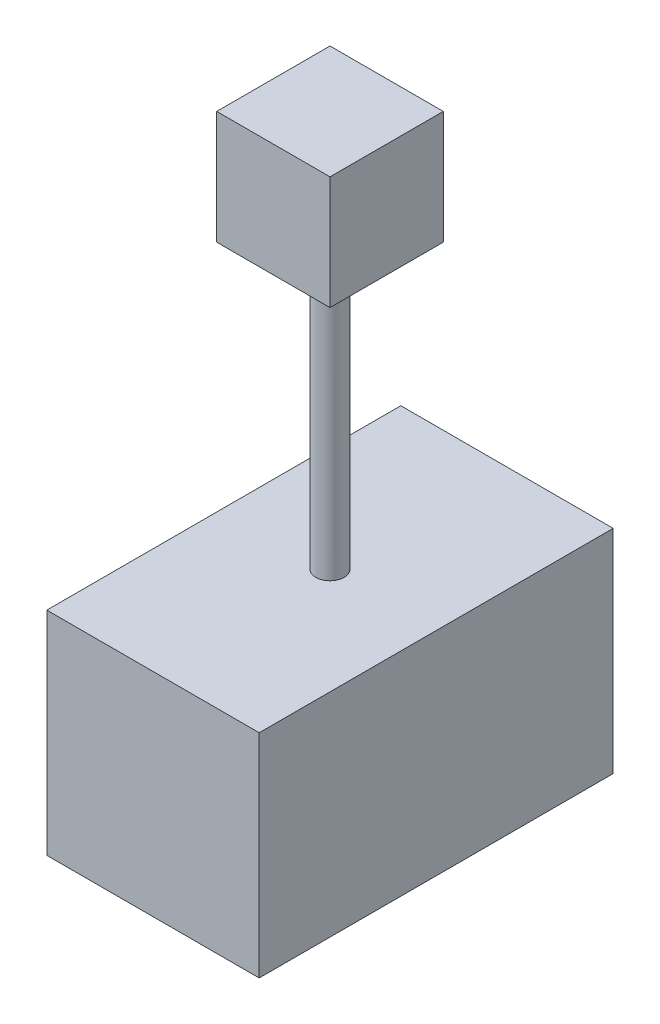
ISO-10303-21;
HEADER;
FILE_DESCRIPTION(('STEP AP214'),'2;1');
FILE_NAME('part.step','',(''),(''),'','','');
FILE_SCHEMA(('AUTOMOTIVE_DESIGN { 1 0 10303 214 1 1 1 1 }'));
ENDSEC;
DATA;
#1=APPLICATION_CONTEXT('core data for automotive mechanical design processes');
#2=APPLICATION_PROTOCOL_DEFINITION('international standard','automotive_design',2000,#1);
#3=PRODUCT_CONTEXT('',#1,'mechanical');
#4=PRODUCT('Part','Part','',(#3));
#5=PRODUCT_RELATED_PRODUCT_CATEGORY('part','',(#4));
#6=PRODUCT_DEFINITION_FORMATION('','',#4);
#7=PRODUCT_DEFINITION_CONTEXT('part definition',#1,'design');
#8=PRODUCT_DEFINITION('design','',#6,#7);
#9=PRODUCT_DEFINITION_SHAPE('','',#8);
#10=(LENGTH_UNIT() NAMED_UNIT(*) SI_UNIT(.MILLI.,.METRE.));
#11=(NAMED_UNIT(*) PLANE_ANGLE_UNIT() SI_UNIT($,.RADIAN.));
#12=(NAMED_UNIT(*) SI_UNIT($,.STERADIAN.) SOLID_ANGLE_UNIT());
#13=UNCERTAINTY_MEASURE_WITH_UNIT(LENGTH_MEASURE(1.E-05),#10,'distance_accuracy_value','');
#14=(GEOMETRIC_REPRESENTATION_CONTEXT(3) GLOBAL_UNCERTAINTY_ASSIGNED_CONTEXT((#13)) GLOBAL_UNIT_ASSIGNED_CONTEXT((#10,
#11,#12)) REPRESENTATION_CONTEXT('',''));
#15=CARTESIAN_POINT('',(0.,0.,0.));
#16=DIRECTION('',(0.,0.,1.));
#17=DIRECTION('',(1.,0.,0.));
#18=AXIS2_PLACEMENT_3D('',#15,#16,#17);
#19=CARTESIAN_POINT('',(0.,150.,-250.));
#20=DIRECTION('',(0.,-1.,0.));
#21=DIRECTION('',(0.,0.,-1.));
#22=AXIS2_PLACEMENT_3D('',#19,#20,#21);
#23=PLANE('',#22);
#24=DIRECTION('',(0.,0.,1.));
#25=VECTOR('',#24,1.);
#26=CARTESIAN_POINT('',(0.,150.,0.));
#27=LINE('',#26,#25);
#28=CARTESIAN_POINT('',(0.,150.,-250.));
#29=VERTEX_POINT('',#28);
#30=CARTESIAN_POINT('',(0.,150.,0.));
#31=VERTEX_POINT('',#30);
#32=EDGE_CURVE('E141',#29,#31,#27,.T.);
#33=ORIENTED_EDGE('',*,*,#32,.T.);
#34=DIRECTION('',(1.,0.,0.));
#35=VECTOR('',#34,1.);
#36=CARTESIAN_POINT('',(0.,150.,0.));
#37=LINE('',#36,#35);
#38=CARTESIAN_POINT('',(150.,150.,0.));
#39=VERTEX_POINT('',#38);
#40=EDGE_CURVE('E80',#31,#39,#37,.T.);
#41=ORIENTED_EDGE('',*,*,#40,.T.);
#42=DIRECTION('',(0.,0.,-1.));
#43=VECTOR('',#42,1.);
#44=CARTESIAN_POINT('',(150.,150.,0.));
#45=LINE('',#44,#43);
#46=CARTESIAN_POINT('',(150.,150.,-250.));
#47=VERTEX_POINT('',#46);
#48=EDGE_CURVE('E144',#39,#47,#45,.T.);
#49=ORIENTED_EDGE('',*,*,#48,.T.);
#50=DIRECTION('',(-1.,0.,0.));
#51=VECTOR('',#50,1.);
#52=CARTESIAN_POINT('',(0.,150.,-250.));
#53=LINE('',#52,#51);
#54=EDGE_CURVE('E48',#47,#29,#53,.T.);
#55=ORIENTED_EDGE('',*,*,#54,.T.);
#56=EDGE_LOOP('',(#33,#41,#49,#55));
#57=FACE_BOUND('',#56,.T.);
#58=CARTESIAN_POINT('',(75.,150.,-125.));
#59=DIRECTION('',(0.,-1.,0.));
#60=DIRECTION('',(0.,0.,-1.));
#61=AXIS2_PLACEMENT_3D('',#58,#59,#60);
#62=CIRCLE('',#61,10.);
#63=CARTESIAN_POINT('',(75.,150.,-135.));
#64=VERTEX_POINT('',#63);
#65=EDGE_CURVE('E11',#64,#64,#62,.F.);
#66=ORIENTED_EDGE('',*,*,#65,.F.);
#67=EDGE_LOOP('',(#66));
#68=FACE_BOUND('',#67,.T.);
#69=ADVANCED_FACE('F31',(#57,#68),#23,.F.);
#70=CARTESIAN_POINT('',(0.,150.,0.));
#71=DIRECTION('',(1.,0.,0.));
#72=DIRECTION('',(0.,0.,-1.));
#73=AXIS2_PLACEMENT_3D('',#70,#71,#72);
#74=PLANE('',#73);
#75=DIRECTION('',(0.,0.,1.));
#76=VECTOR('',#75,1.);
#77=CARTESIAN_POINT('',(0.,0.,0.));
#78=LINE('',#77,#76);
#79=CARTESIAN_POINT('',(0.,0.,-250.));
#80=VERTEX_POINT('',#79);
#81=CARTESIAN_POINT('',(0.,0.,0.));
#82=VERTEX_POINT('',#81);
#83=EDGE_CURVE('E135',#80,#82,#78,.T.);
#84=ORIENTED_EDGE('',*,*,#83,.T.);
#85=DIRECTION('',(0.,-1.,0.));
#86=VECTOR('',#85,1.);
#87=CARTESIAN_POINT('',(0.,150.,0.));
#88=LINE('',#87,#86);
#89=EDGE_CURVE('E40',#31,#82,#88,.T.);
#90=ORIENTED_EDGE('',*,*,#89,.F.);
#91=ORIENTED_EDGE('',*,*,#32,.F.);
#92=DIRECTION('',(0.,-1.,0.));
#93=VECTOR('',#92,1.);
#94=CARTESIAN_POINT('',(0.,150.,-250.));
#95=LINE('',#94,#93);
#96=EDGE_CURVE('E147',#29,#80,#95,.T.);
#97=ORIENTED_EDGE('',*,*,#96,.T.);
#98=EDGE_LOOP('',(#84,#90,#91,#97));
#99=FACE_BOUND('',#98,.T.);
#100=ADVANCED_FACE('F33',(#99),#74,.F.);
#101=CARTESIAN_POINT('',(0.,150.,0.));
#102=DIRECTION('',(0.,0.,-1.));
#103=DIRECTION('',(-1.,0.,0.));
#104=AXIS2_PLACEMENT_3D('',#101,#102,#103);
#105=PLANE('',#104);
#106=DIRECTION('',(1.,0.,0.));
#107=VECTOR('',#106,1.);
#108=CARTESIAN_POINT('',(0.,0.,0.));
#109=LINE('',#108,#107);
#110=CARTESIAN_POINT('',(150.,0.,0.));
#111=VERTEX_POINT('',#110);
#112=EDGE_CURVE('E150',#82,#111,#109,.T.);
#113=ORIENTED_EDGE('',*,*,#112,.T.);
#114=DIRECTION('',(0.,-1.,0.));
#115=VECTOR('',#114,1.);
#116=CARTESIAN_POINT('',(150.,150.,0.));
#117=LINE('',#116,#115);
#118=EDGE_CURVE('E157',#39,#111,#117,.T.);
#119=ORIENTED_EDGE('',*,*,#118,.F.);
#120=ORIENTED_EDGE('',*,*,#40,.F.);
#121=ORIENTED_EDGE('',*,*,#89,.T.);
#122=EDGE_LOOP('',(#113,#119,#120,#121));
#123=FACE_BOUND('',#122,.T.);
#124=ADVANCED_FACE('F159',(#123),#105,.F.);
#125=CARTESIAN_POINT('',(150.,150.,0.));
#126=DIRECTION('',(-1.,0.,0.));
#127=DIRECTION('',(0.,0.,1.));
#128=AXIS2_PLACEMENT_3D('',#125,#126,#127);
#129=PLANE('',#128);
#130=DIRECTION('',(0.,0.,-1.));
#131=VECTOR('',#130,1.);
#132=CARTESIAN_POINT('',(150.,0.,0.));
#133=LINE('',#132,#131);
#134=CARTESIAN_POINT('',(150.,0.,-250.));
#135=VERTEX_POINT('',#134);
#136=EDGE_CURVE('E66',#111,#135,#133,.T.);
#137=ORIENTED_EDGE('',*,*,#136,.T.);
#138=DIRECTION('',(0.,-1.,0.));
#139=VECTOR('',#138,1.);
#140=CARTESIAN_POINT('',(150.,150.,-250.));
#141=LINE('',#140,#139);
#142=EDGE_CURVE('E155',#47,#135,#141,.T.);
#143=ORIENTED_EDGE('',*,*,#142,.F.);
#144=ORIENTED_EDGE('',*,*,#48,.F.);
#145=ORIENTED_EDGE('',*,*,#118,.T.);
#146=EDGE_LOOP('',(#137,#143,#144,#145));
#147=FACE_BOUND('',#146,.T.);
#148=ADVANCED_FACE('F176',(#147),#129,.F.);
#149=CARTESIAN_POINT('',(0.,150.,-250.));
#150=DIRECTION('',(0.,0.,1.));
#151=DIRECTION('',(1.,0.,0.));
#152=AXIS2_PLACEMENT_3D('',#149,#150,#151);
#153=PLANE('',#152);
#154=DIRECTION('',(-1.,0.,0.));
#155=VECTOR('',#154,1.);
#156=CARTESIAN_POINT('',(0.,0.,-250.));
#157=LINE('',#156,#155);
#158=EDGE_CURVE('E72',#135,#80,#157,.T.);
#159=ORIENTED_EDGE('',*,*,#158,.T.);
#160=ORIENTED_EDGE('',*,*,#96,.F.);
#161=ORIENTED_EDGE('',*,*,#54,.F.);
#162=ORIENTED_EDGE('',*,*,#142,.T.);
#163=EDGE_LOOP('',(#159,#160,#161,#162));
#164=FACE_BOUND('',#163,.T.);
#165=ADVANCED_FACE('F167',(#164),#153,.F.);
#166=CARTESIAN_POINT('',(0.,0.,-250.));
#167=DIRECTION('',(0.,-1.,0.));
#168=DIRECTION('',(0.,0.,-1.));
#169=AXIS2_PLACEMENT_3D('',#166,#167,#168);
#170=PLANE('',#169);
#171=ORIENTED_EDGE('',*,*,#83,.F.);
#172=ORIENTED_EDGE('',*,*,#158,.F.);
#173=ORIENTED_EDGE('',*,*,#136,.F.);
#174=ORIENTED_EDGE('',*,*,#112,.F.);
#175=EDGE_LOOP('',(#171,#172,#173,#174));
#176=FACE_BOUND('',#175,.T.);
#177=ADVANCED_FACE('F164',(#176),#170,.T.);
#178=CARTESIAN_POINT('',(75.,350.,-125.));
#179=DIRECTION('',(0.,-1.,0.));
#180=DIRECTION('',(0.,0.,-1.));
#181=AXIS2_PLACEMENT_3D('',#178,#179,#180);
#182=CYLINDRICAL_SURFACE('',#181,10.);
#183=CARTESIAN_POINT('',(75.,350.,-125.));
#184=DIRECTION('',(0.,1.,0.));
#185=DIRECTION('',(0.,0.,1.));
#186=AXIS2_PLACEMENT_3D('',#183,#184,#185);
#187=CIRCLE('',#186,10.);
#188=CARTESIAN_POINT('',(75.,350.,-115.));
#189=VERTEX_POINT('',#188);
#190=EDGE_CURVE('E132',#189,#189,#187,.T.);
#191=ORIENTED_EDGE('',*,*,#190,.F.);
#192=EDGE_LOOP('',(#191));
#193=FACE_BOUND('',#192,.T.);
#194=ORIENTED_EDGE('',*,*,#65,.T.);
#195=EDGE_LOOP('',(#194));
#196=FACE_BOUND('',#195,.T.);
#197=ADVANCED_FACE('F166',(#193,#196),#182,.T.);
#198=CARTESIAN_POINT('',(35.,350.,-85.));
#199=DIRECTION('',(0.,1.,0.));
#200=DIRECTION('',(0.,0.,1.));
#201=AXIS2_PLACEMENT_3D('',#198,#199,#200);
#202=PLANE('',#201);
#203=DIRECTION('',(0.,0.,1.));
#204=VECTOR('',#203,1.);
#205=CARTESIAN_POINT('',(35.,350.,-165.));
#206=LINE('',#205,#204);
#207=CARTESIAN_POINT('',(35.,350.,-165.));
#208=VERTEX_POINT('',#207);
#209=CARTESIAN_POINT('',(35.,350.,-85.));
#210=VERTEX_POINT('',#209);
#211=EDGE_CURVE('E131',#208,#210,#206,.T.);
#212=ORIENTED_EDGE('',*,*,#211,.F.);
#213=DIRECTION('',(-1.,0.,0.));
#214=VECTOR('',#213,1.);
#215=CARTESIAN_POINT('',(35.,350.,-165.));
#216=LINE('',#215,#214);
#217=CARTESIAN_POINT('',(115.,350.,-165.));
#218=VERTEX_POINT('',#217);
#219=EDGE_CURVE('E127',#218,#208,#216,.T.);
#220=ORIENTED_EDGE('',*,*,#219,.F.);
#221=DIRECTION('',(0.,0.,-1.));
#222=VECTOR('',#221,1.);
#223=CARTESIAN_POINT('',(115.,350.,-165.));
#224=LINE('',#223,#222);
#225=CARTESIAN_POINT('',(115.,350.,-85.));
#226=VERTEX_POINT('',#225);
#227=EDGE_CURVE('E286',#226,#218,#224,.T.);
#228=ORIENTED_EDGE('',*,*,#227,.F.);
#229=DIRECTION('',(1.,0.,0.));
#230=VECTOR('',#229,1.);
#231=CARTESIAN_POINT('',(35.,350.,-85.));
#232=LINE('',#231,#230);
#233=EDGE_CURVE('E284',#210,#226,#232,.T.);
#234=ORIENTED_EDGE('',*,*,#233,.F.);
#235=EDGE_LOOP('',(#212,#220,#228,#234));
#236=FACE_BOUND('',#235,.T.);
#237=ORIENTED_EDGE('',*,*,#190,.T.);
#238=EDGE_LOOP('',(#237));
#239=FACE_BOUND('',#238,.T.);
#240=ADVANCED_FACE('F173',(#236,#239),#202,.F.);
#241=CARTESIAN_POINT('',(35.,430.,-165.));
#242=DIRECTION('',(1.,0.,0.));
#243=DIRECTION('',(0.,0.,-1.));
#244=AXIS2_PLACEMENT_3D('',#241,#242,#243);
#245=PLANE('',#244);
#246=ORIENTED_EDGE('',*,*,#211,.T.);
#247=DIRECTION('',(0.,-1.,0.));
#248=VECTOR('',#247,1.);
#249=CARTESIAN_POINT('',(35.,430.,-85.));
#250=LINE('',#249,#248);
#251=CARTESIAN_POINT('',(35.,430.,-85.));
#252=VERTEX_POINT('',#251);
#253=EDGE_CURVE('E111',#252,#210,#250,.T.);
#254=ORIENTED_EDGE('',*,*,#253,.F.);
#255=DIRECTION('',(0.,0.,1.));
#256=VECTOR('',#255,1.);
#257=CARTESIAN_POINT('',(35.,430.,-165.));
#258=LINE('',#257,#256);
#259=CARTESIAN_POINT('',(35.,430.,-165.));
#260=VERTEX_POINT('',#259);
#261=EDGE_CURVE('E118',#260,#252,#258,.T.);
#262=ORIENTED_EDGE('',*,*,#261,.F.);
#263=DIRECTION('',(0.,-1.,0.));
#264=VECTOR('',#263,1.);
#265=CARTESIAN_POINT('',(35.,430.,-165.));
#266=LINE('',#265,#264);
#267=EDGE_CURVE('E293',#260,#208,#266,.T.);
#268=ORIENTED_EDGE('',*,*,#267,.T.);
#269=EDGE_LOOP('',(#246,#254,#262,#268));
#270=FACE_BOUND('',#269,.T.);
#271=ADVANCED_FACE('F129',(#270),#245,.F.);
#272=CARTESIAN_POINT('',(35.,430.,-85.));
#273=DIRECTION('',(0.,0.,-1.));
#274=DIRECTION('',(-1.,0.,0.));
#275=AXIS2_PLACEMENT_3D('',#272,#273,#274);
#276=PLANE('',#275);
#277=ORIENTED_EDGE('',*,*,#233,.T.);
#278=DIRECTION('',(0.,-1.,0.));
#279=VECTOR('',#278,1.);
#280=CARTESIAN_POINT('',(115.,430.,-85.));
#281=LINE('',#280,#279);
#282=CARTESIAN_POINT('',(115.,430.,-85.));
#283=VERTEX_POINT('',#282);
#284=EDGE_CURVE('E114',#283,#226,#281,.T.);
#285=ORIENTED_EDGE('',*,*,#284,.F.);
#286=DIRECTION('',(1.,0.,0.));
#287=VECTOR('',#286,1.);
#288=CARTESIAN_POINT('',(35.,430.,-85.));
#289=LINE('',#288,#287);
#290=EDGE_CURVE('E107',#252,#283,#289,.T.);
#291=ORIENTED_EDGE('',*,*,#290,.F.);
#292=ORIENTED_EDGE('',*,*,#253,.T.);
#293=EDGE_LOOP('',(#277,#285,#291,#292));
#294=FACE_BOUND('',#293,.T.);
#295=ADVANCED_FACE('F109',(#294),#276,.F.);
#296=CARTESIAN_POINT('',(115.,430.,-165.));
#297=DIRECTION('',(-1.,0.,0.));
#298=DIRECTION('',(0.,0.,1.));
#299=AXIS2_PLACEMENT_3D('',#296,#297,#298);
#300=PLANE('',#299);
#301=ORIENTED_EDGE('',*,*,#227,.T.);
#302=DIRECTION('',(0.,-1.,0.));
#303=VECTOR('',#302,1.);
#304=CARTESIAN_POINT('',(115.,430.,-165.));
#305=LINE('',#304,#303);
#306=CARTESIAN_POINT('',(115.,430.,-165.));
#307=VERTEX_POINT('',#306);
#308=EDGE_CURVE('E137',#307,#218,#305,.T.);
#309=ORIENTED_EDGE('',*,*,#308,.F.);
#310=DIRECTION('',(0.,0.,-1.));
#311=VECTOR('',#310,1.);
#312=CARTESIAN_POINT('',(115.,430.,-165.));
#313=LINE('',#312,#311);
#314=EDGE_CURVE('E117',#283,#307,#313,.T.);
#315=ORIENTED_EDGE('',*,*,#314,.F.);
#316=ORIENTED_EDGE('',*,*,#284,.T.);
#317=EDGE_LOOP('',(#301,#309,#315,#316));
#318=FACE_BOUND('',#317,.T.);
#319=ADVANCED_FACE('F189',(#318),#300,.F.);
#320=CARTESIAN_POINT('',(35.,430.,-165.));
#321=DIRECTION('',(0.,0.,1.));
#322=DIRECTION('',(1.,0.,0.));
#323=AXIS2_PLACEMENT_3D('',#320,#321,#322);
#324=PLANE('',#323);
#325=ORIENTED_EDGE('',*,*,#219,.T.);
#326=ORIENTED_EDGE('',*,*,#267,.F.);
#327=DIRECTION('',(-1.,0.,0.));
#328=VECTOR('',#327,1.);
#329=CARTESIAN_POINT('',(35.,430.,-165.));
#330=LINE('',#329,#328);
#331=EDGE_CURVE('E123',#307,#260,#330,.T.);
#332=ORIENTED_EDGE('',*,*,#331,.F.);
#333=ORIENTED_EDGE('',*,*,#308,.T.);
#334=EDGE_LOOP('',(#325,#326,#332,#333));
#335=FACE_BOUND('',#334,.T.);
#336=ADVANCED_FACE('F192',(#335),#324,.F.);
#337=CARTESIAN_POINT('',(35.,430.,-85.));
#338=DIRECTION('',(0.,1.,0.));
#339=DIRECTION('',(0.,0.,1.));
#340=AXIS2_PLACEMENT_3D('',#337,#338,#339);
#341=PLANE('',#340);
#342=ORIENTED_EDGE('',*,*,#261,.T.);
#343=ORIENTED_EDGE('',*,*,#290,.T.);
#344=ORIENTED_EDGE('',*,*,#314,.T.);
#345=ORIENTED_EDGE('',*,*,#331,.T.);
#346=EDGE_LOOP('',(#342,#343,#344,#345));
#347=FACE_BOUND('',#346,.T.);
#348=ADVANCED_FACE('F121',(#347),#341,.T.);
#349=CLOSED_SHELL('',(#69,#100,#124,#148,#165,#177,#197,#240,#271,#295,#319,#336,#348));
#350=MANIFOLD_SOLID_BREP('B2',#349);
#351=ADVANCED_BREP_SHAPE_REPRESENTATION('',(#18,#350),#14);
#352=SHAPE_DEFINITION_REPRESENTATION(#9,#351);
ENDSEC;
END-ISO-10303-21;
